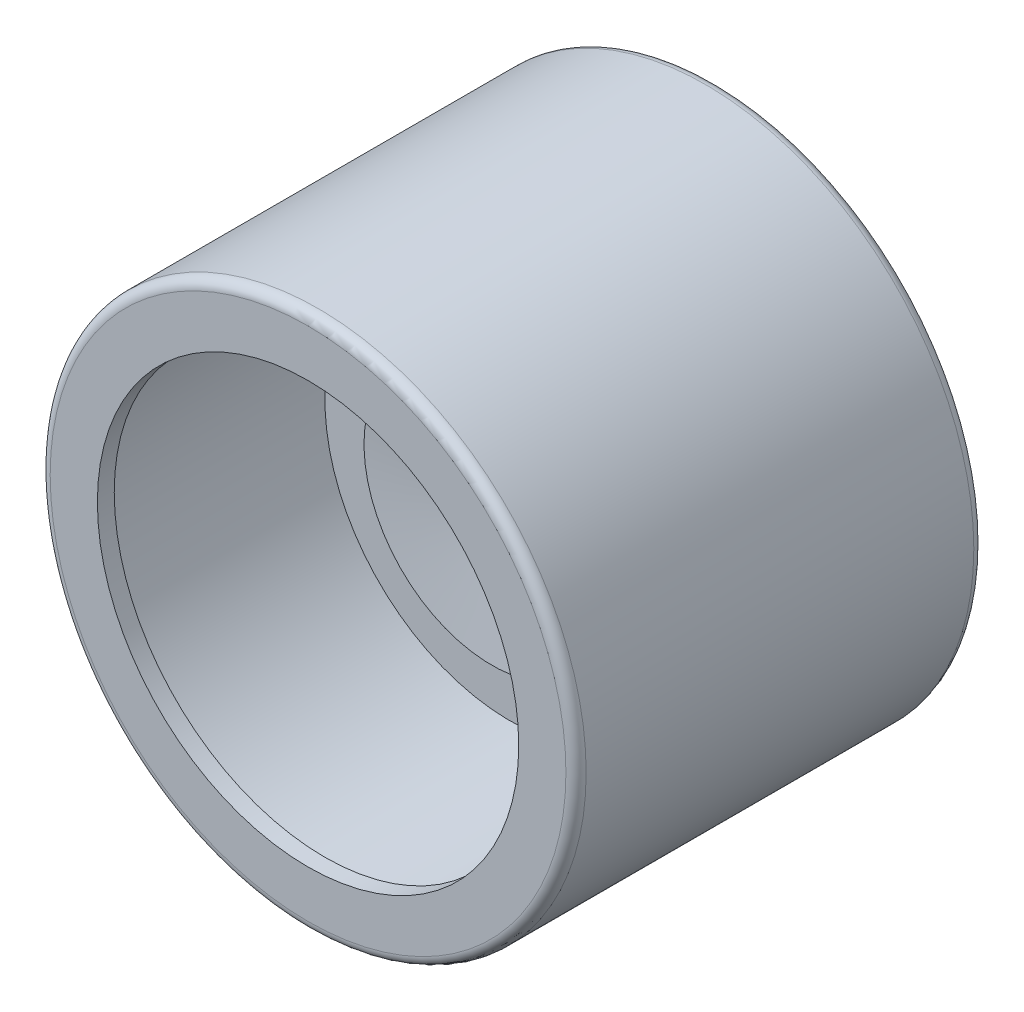
ISO-10303-21;
HEADER;
FILE_DESCRIPTION(('STEP AP214'),'2;1');
FILE_NAME('part.step','',(''),(''),'','','');
FILE_SCHEMA(('AUTOMOTIVE_DESIGN { 1 0 10303 214 1 1 1 1 }'));
ENDSEC;
DATA;
#1=APPLICATION_CONTEXT('core data for automotive mechanical design processes');
#2=APPLICATION_PROTOCOL_DEFINITION('international standard','automotive_design',2000,#1);
#3=PRODUCT_CONTEXT('',#1,'mechanical');
#4=PRODUCT('Part','Part','',(#3));
#5=PRODUCT_RELATED_PRODUCT_CATEGORY('part','',(#4));
#6=PRODUCT_DEFINITION_FORMATION('','',#4);
#7=PRODUCT_DEFINITION_CONTEXT('part definition',#1,'design');
#8=PRODUCT_DEFINITION('design','',#6,#7);
#9=PRODUCT_DEFINITION_SHAPE('','',#8);
#10=(LENGTH_UNIT() NAMED_UNIT(*) SI_UNIT(.MILLI.,.METRE.));
#11=(NAMED_UNIT(*) PLANE_ANGLE_UNIT() SI_UNIT($,.RADIAN.));
#12=(NAMED_UNIT(*) SI_UNIT($,.STERADIAN.) SOLID_ANGLE_UNIT());
#13=UNCERTAINTY_MEASURE_WITH_UNIT(LENGTH_MEASURE(1.E-05),#10,'distance_accuracy_value','');
#14=(GEOMETRIC_REPRESENTATION_CONTEXT(3) GLOBAL_UNCERTAINTY_ASSIGNED_CONTEXT((#13)) GLOBAL_UNIT_ASSIGNED_CONTEXT((#10,
#11,#12)) REPRESENTATION_CONTEXT('',''));
#15=CARTESIAN_POINT('',(0.,0.,0.));
#16=DIRECTION('',(0.,0.,1.));
#17=DIRECTION('',(1.,0.,0.));
#18=AXIS2_PLACEMENT_3D('',#15,#16,#17);
#19=CARTESIAN_POINT('',(0.,0.,6.1));
#20=DIRECTION('',(0.,0.,1.));
#21=DIRECTION('',(1.,0.,0.));
#22=AXIS2_PLACEMENT_3D('',#19,#20,#21);
#23=PLANE('',#22);
#24=CARTESIAN_POINT('',(0.,0.,6.1));
#25=DIRECTION('',(0.,0.,1.));
#26=DIRECTION('',(1.,0.,0.));
#27=AXIS2_PLACEMENT_3D('',#24,#25,#26);
#28=CIRCLE('',#27,5.5);
#29=CARTESIAN_POINT('',(5.5,0.,6.1));
#30=VERTEX_POINT('',#29);
#31=EDGE_CURVE('E86',#30,#30,#28,.T.);
#32=ORIENTED_EDGE('',*,*,#31,.T.);
#33=EDGE_LOOP('',(#32));
#34=FACE_BOUND('',#33,.T.);
#35=CARTESIAN_POINT('',(0.,0.,6.1));
#36=DIRECTION('',(0.,0.,1.));
#37=DIRECTION('',(1.,0.,0.));
#38=AXIS2_PLACEMENT_3D('',#35,#36,#37);
#39=CIRCLE('',#38,3.7909010050328);
#40=CARTESIAN_POINT('',(3.7909010050328,0.,6.1));
#41=VERTEX_POINT('',#40);
#42=EDGE_CURVE('E13',#41,#41,#39,.T.);
#43=ORIENTED_EDGE('',*,*,#42,.F.);
#44=EDGE_LOOP('',(#43));
#45=FACE_BOUND('',#44,.T.);
#46=ADVANCED_FACE('F50',(#34,#45),#23,.T.);
#47=CARTESIAN_POINT('',(0.,0.,12.1));
#48=DIRECTION('',(0.,0.,-1.));
#49=DIRECTION('',(-1.,0.,0.));
#50=AXIS2_PLACEMENT_3D('',#47,#48,#49);
#51=CYLINDRICAL_SURFACE('',#50,7.95);
#52=CARTESIAN_POINT('',(0.,0.,0.3));
#53=DIRECTION('',(0.,0.,1.));
#54=DIRECTION('',(1.,0.,0.));
#55=AXIS2_PLACEMENT_3D('',#52,#53,#54);
#56=CIRCLE('',#55,7.95);
#57=CARTESIAN_POINT('',(7.95,0.,0.3));
#58=VERTEX_POINT('',#57);
#59=EDGE_CURVE('E73',#58,#58,#56,.T.);
#60=ORIENTED_EDGE('',*,*,#59,.T.);
#61=EDGE_LOOP('',(#60));
#62=FACE_BOUND('',#61,.T.);
#63=CARTESIAN_POINT('',(0.,0.,11.8));
#64=DIRECTION('',(0.,0.,1.));
#65=DIRECTION('',(1.,0.,0.));
#66=AXIS2_PLACEMENT_3D('',#63,#64,#65);
#67=CIRCLE('',#66,7.95);
#68=CARTESIAN_POINT('',(7.95,0.,11.8));
#69=VERTEX_POINT('',#68);
#70=EDGE_CURVE('E76',#69,#69,#67,.F.);
#71=ORIENTED_EDGE('',*,*,#70,.T.);
#72=EDGE_LOOP('',(#71));
#73=FACE_BOUND('',#72,.T.);
#74=ADVANCED_FACE('F120',(#62,#73),#51,.T.);
#75=CARTESIAN_POINT('',(0.,0.,12.1));
#76=DIRECTION('',(0.,0.,1.));
#77=DIRECTION('',(1.,0.,0.));
#78=AXIS2_PLACEMENT_3D('',#75,#76,#77);
#79=PLANE('',#78);
#80=CARTESIAN_POINT('',(0.,0.,12.1));
#81=DIRECTION('',(0.,0.,1.));
#82=DIRECTION('',(1.,0.,0.));
#83=AXIS2_PLACEMENT_3D('',#80,#81,#82);
#84=CIRCLE('',#83,7.65);
#85=CARTESIAN_POINT('',(7.65,0.,12.1));
#86=VERTEX_POINT('',#85);
#87=EDGE_CURVE('E65',#86,#86,#84,.T.);
#88=ORIENTED_EDGE('',*,*,#87,.T.);
#89=EDGE_LOOP('',(#88));
#90=FACE_BOUND('',#89,.T.);
#91=CARTESIAN_POINT('',(0.,0.,12.1));
#92=DIRECTION('',(0.,0.,1.));
#93=DIRECTION('',(1.,0.,0.));
#94=AXIS2_PLACEMENT_3D('',#91,#92,#93);
#95=CIRCLE('',#94,6.25);
#96=CARTESIAN_POINT('',(6.25,0.,12.1));
#97=VERTEX_POINT('',#96);
#98=EDGE_CURVE('E83',#97,#97,#95,.T.);
#99=ORIENTED_EDGE('',*,*,#98,.F.);
#100=EDGE_LOOP('',(#99));
#101=FACE_BOUND('',#100,.T.);
#102=ADVANCED_FACE('F125',(#90,#101),#79,.T.);
#103=CARTESIAN_POINT('',(0.,0.,0.));
#104=DIRECTION('',(0.,0.,1.));
#105=DIRECTION('',(1.,0.,0.));
#106=AXIS2_PLACEMENT_3D('',#103,#104,#105);
#107=PLANE('',#106);
#108=CARTESIAN_POINT('',(0.,0.,0.));
#109=DIRECTION('',(0.,0.,1.));
#110=DIRECTION('',(1.,0.,0.));
#111=AXIS2_PLACEMENT_3D('',#108,#109,#110);
#112=CIRCLE('',#111,7.65);
#113=CARTESIAN_POINT('',(7.65,0.,0.));
#114=VERTEX_POINT('',#113);
#115=EDGE_CURVE('E70',#114,#114,#112,.F.);
#116=ORIENTED_EDGE('',*,*,#115,.T.);
#117=EDGE_LOOP('',(#116));
#118=FACE_BOUND('',#117,.T.);
#119=ADVANCED_FACE('F155',(#118),#107,.F.);
#120=CARTESIAN_POINT('',(0.,0.,0.3));
#121=DIRECTION('',(0.,0.,1.));
#122=DIRECTION('',(1.,0.,0.));
#123=AXIS2_PLACEMENT_3D('',#120,#121,#122);
#124=TOROIDAL_SURFACE('',#123,7.65,0.3);
#125=ORIENTED_EDGE('',*,*,#115,.F.);
#126=EDGE_LOOP('',(#125));
#127=FACE_BOUND('',#126,.T.);
#128=ORIENTED_EDGE('',*,*,#59,.F.);
#129=EDGE_LOOP('',(#128));
#130=FACE_BOUND('',#129,.T.);
#131=ADVANCED_FACE('F158',(#127,#130),#124,.T.);
#132=CARTESIAN_POINT('',(0.,0.,11.8));
#133=DIRECTION('',(0.,0.,1.));
#134=DIRECTION('',(1.,0.,0.));
#135=AXIS2_PLACEMENT_3D('',#132,#133,#134);
#136=TOROIDAL_SURFACE('',#135,7.65,0.3);
#137=ORIENTED_EDGE('',*,*,#70,.F.);
#138=EDGE_LOOP('',(#137));
#139=FACE_BOUND('',#138,.T.);
#140=ORIENTED_EDGE('',*,*,#87,.F.);
#141=EDGE_LOOP('',(#140));
#142=FACE_BOUND('',#141,.T.);
#143=ADVANCED_FACE('F52',(#139,#142),#136,.T.);
#144=CARTESIAN_POINT('',(0.,0.,11.6));
#145=DIRECTION('',(0.,0.,1.));
#146=DIRECTION('',(1.,0.,0.));
#147=AXIS2_PLACEMENT_3D('',#144,#145,#146);
#148=PLANE('',#147);
#149=CARTESIAN_POINT('',(0.,0.,11.6));
#150=DIRECTION('',(0.,0.,1.));
#151=DIRECTION('',(1.,0.,0.));
#152=AXIS2_PLACEMENT_3D('',#149,#150,#151);
#153=CIRCLE('',#152,6.25);
#154=CARTESIAN_POINT('',(6.25,0.,11.6));
#155=VERTEX_POINT('',#154);
#156=EDGE_CURVE('E82',#155,#155,#153,.T.);
#157=ORIENTED_EDGE('',*,*,#156,.T.);
#158=EDGE_LOOP('',(#157));
#159=FACE_BOUND('',#158,.T.);
#160=CARTESIAN_POINT('',(0.,0.,11.6));
#161=DIRECTION('',(0.,0.,1.));
#162=DIRECTION('',(1.,0.,0.));
#163=AXIS2_PLACEMENT_3D('',#160,#161,#162);
#164=CIRCLE('',#163,7.5);
#165=CARTESIAN_POINT('',(7.5,0.,11.6));
#166=VERTEX_POINT('',#165);
#167=EDGE_CURVE('E61',#166,#166,#164,.F.);
#168=ORIENTED_EDGE('',*,*,#167,.T.);
#169=EDGE_LOOP('',(#168));
#170=FACE_BOUND('',#169,.T.);
#171=ADVANCED_FACE('F142',(#159,#170),#148,.F.);
#172=CARTESIAN_POINT('',(0.,0.,11.6));
#173=DIRECTION('',(0.,0.,1.));
#174=DIRECTION('',(1.,0.,0.));
#175=AXIS2_PLACEMENT_3D('',#172,#173,#174);
#176=CYLINDRICAL_SURFACE('',#175,6.25);
#177=ORIENTED_EDGE('',*,*,#156,.F.);
#178=EDGE_LOOP('',(#177));
#179=FACE_BOUND('',#178,.T.);
#180=ORIENTED_EDGE('',*,*,#98,.T.);
#181=EDGE_LOOP('',(#180));
#182=FACE_BOUND('',#181,.T.);
#183=ADVANCED_FACE('F138',(#179,#182),#176,.F.);
#184=CARTESIAN_POINT('',(0.,0.,2.1));
#185=DIRECTION('',(0.,0.,1.));
#186=DIRECTION('',(1.,0.,0.));
#187=AXIS2_PLACEMENT_3D('',#184,#185,#186);
#188=PLANE('',#187);
#189=CARTESIAN_POINT('',(0.,0.,2.1));
#190=DIRECTION('',(0.,0.,1.));
#191=DIRECTION('',(1.,0.,0.));
#192=AXIS2_PLACEMENT_3D('',#189,#190,#191);
#193=CIRCLE('',#192,5.5);
#194=CARTESIAN_POINT('',(5.5,0.,2.1));
#195=VERTEX_POINT('',#194);
#196=EDGE_CURVE('E89',#195,#195,#193,.T.);
#197=ORIENTED_EDGE('',*,*,#196,.F.);
#198=EDGE_LOOP('',(#197));
#199=FACE_BOUND('',#198,.T.);
#200=CARTESIAN_POINT('',(0.,0.,2.1));
#201=DIRECTION('',(0.,0.,1.));
#202=DIRECTION('',(1.,0.,0.));
#203=AXIS2_PLACEMENT_3D('',#200,#201,#202);
#204=CIRCLE('',#203,7.5);
#205=CARTESIAN_POINT('',(7.5,0.,2.1));
#206=VERTEX_POINT('',#205);
#207=EDGE_CURVE('E79',#206,#206,#204,.T.);
#208=ORIENTED_EDGE('',*,*,#207,.T.);
#209=EDGE_LOOP('',(#208));
#210=FACE_BOUND('',#209,.T.);
#211=ADVANCED_FACE('F141',(#199,#210),#188,.T.);
#212=CARTESIAN_POINT('',(0.,0.,2.1));
#213=DIRECTION('',(0.,0.,1.));
#214=DIRECTION('',(1.,0.,0.));
#215=AXIS2_PLACEMENT_3D('',#212,#213,#214);
#216=CYLINDRICAL_SURFACE('',#215,7.5);
#217=ORIENTED_EDGE('',*,*,#207,.F.);
#218=EDGE_LOOP('',(#217));
#219=FACE_BOUND('',#218,.T.);
#220=ORIENTED_EDGE('',*,*,#167,.F.);
#221=EDGE_LOOP('',(#220));
#222=FACE_BOUND('',#221,.T.);
#223=ADVANCED_FACE('F136',(#219,#222),#216,.F.);
#224=CARTESIAN_POINT('',(0.,0.,6.1));
#225=DIRECTION('',(0.,0.,-1.));
#226=DIRECTION('',(-1.,0.,0.));
#227=AXIS2_PLACEMENT_3D('',#224,#225,#226);
#228=CYLINDRICAL_SURFACE('',#227,5.5);
#229=ORIENTED_EDGE('',*,*,#31,.F.);
#230=EDGE_LOOP('',(#229));
#231=FACE_BOUND('',#230,.T.);
#232=ORIENTED_EDGE('',*,*,#196,.T.);
#233=EDGE_LOOP('',(#232));
#234=FACE_BOUND('',#233,.T.);
#235=ADVANCED_FACE('F133',(#231,#234),#228,.T.);
#236=CARTESIAN_POINT('',(0.,0.,0.));
#237=DIRECTION('',(0.,0.,-1.));
#238=DIRECTION('',(0.,1.,0.));
#239=AXIS2_PLACEMENT_3D('',#236,#237,#238);
#240=CYLINDRICAL_SURFACE('',#239,3.7909010050328);
#241=ORIENTED_EDGE('',*,*,#42,.T.);
#242=EDGE_LOOP('',(#241));
#243=FACE_BOUND('',#242,.T.);
#244=CARTESIAN_POINT('',(0.,0.,6.65));
#245=DIRECTION('',(0.,0.,-1.));
#246=DIRECTION('',(0.,1.,0.));
#247=AXIS2_PLACEMENT_3D('',#244,#245,#246);
#248=CIRCLE('',#247,3.7909010050328);
#249=CARTESIAN_POINT('',(0.,3.7909010050328,6.65));
#250=VERTEX_POINT('',#249);
#251=EDGE_CURVE('E92',#250,#250,#248,.T.);
#252=ORIENTED_EDGE('',*,*,#251,.T.);
#253=EDGE_LOOP('',(#252));
#254=FACE_BOUND('',#253,.T.);
#255=ADVANCED_FACE('F131',(#243,#254),#240,.T.);
#256=CARTESIAN_POINT('',(0.,0.,6.65));
#257=DIRECTION('',(0.,0.,1.));
#258=DIRECTION('',(0.,-1.,0.));
#259=AXIS2_PLACEMENT_3D('',#256,#257,#258);
#260=CONICAL_SURFACE('',#259,3.7909010050328,1.45108807305091);
#261=CARTESIAN_POINT('',(0.,0.,6.31884257165239));
#262=DIRECTION('',(0.,0.,-1.));
#263=DIRECTION('',(0.,1.,0.));
#264=AXIS2_PLACEMENT_3D('',#261,#262,#263);
#265=CIRCLE('',#264,1.03775684955081);
#266=CARTESIAN_POINT('',(0.,1.03775684955081,6.31884257165239));
#267=VERTEX_POINT('',#266);
#268=EDGE_CURVE('E97',#267,#267,#265,.T.);
#269=ORIENTED_EDGE('',*,*,#268,.T.);
#270=EDGE_LOOP('',(#269));
#271=FACE_BOUND('',#270,.T.);
#272=ORIENTED_EDGE('',*,*,#251,.F.);
#273=EDGE_LOOP('',(#272));
#274=FACE_BOUND('',#273,.T.);
#275=ADVANCED_FACE('F117',(#271,#274),#260,.F.);
#276=CARTESIAN_POINT('',(0.,0.,4.82957729286775));
#277=DIRECTION('',(0.,0.,-1.));
#278=DIRECTION('',(0.,1.,0.));
#279=AXIS2_PLACEMENT_3D('',#276,#277,#278);
#280=DEGENERATE_TOROIDAL_SURFACE('',#279,1.21689068054462,1.5,.T.);
#281=CARTESIAN_POINT('',(0.,0.,6.1194532886291));
#282=DIRECTION('',(0.,0.,-1.));
#283=DIRECTION('',(0.,1.,0.));
#284=AXIS2_PLACEMENT_3D('',#281,#282,#283);
#285=CIRCLE('',#284,0.451240685077581);
#286=CARTESIAN_POINT('',(0.,0.45124068507758,6.1194532886291));
#287=VERTEX_POINT('',#286);
#288=EDGE_CURVE('E100',#287,#287,#285,.T.);
#289=ORIENTED_EDGE('',*,*,#288,.T.);
#290=EDGE_LOOP('',(#289));
#291=FACE_BOUND('',#290,.T.);
#292=ORIENTED_EDGE('',*,*,#268,.F.);
#293=EDGE_LOOP('',(#292));
#294=FACE_BOUND('',#293,.T.);
#295=ADVANCED_FACE('F104',(#291,#294),#280,.T.);
#296=CARTESIAN_POINT('',(0.,0.,6.1194532886291));
#297=DIRECTION('',(0.,0.,1.));
#298=DIRECTION('',(0.,-1.,0.));
#299=AXIS2_PLACEMENT_3D('',#296,#297,#298);
#300=CONICAL_SURFACE('',#299,0.451240685077581,1.0351076909461);
#301=CARTESIAN_POINT('',(0.,0.,6.1));
#302=DIRECTION('',(0.,0.,1.));
#303=DIRECTION('',(1.,0.,0.));
#304=AXIS2_PLACEMENT_3D('',#301,#302,#303);
#305=CIRCLE('',#304,0.418468099444649);
#306=CARTESIAN_POINT('',(0.418468099444649,0.,6.1));
#307=VERTEX_POINT('',#306);
#308=EDGE_CURVE('E57',#307,#307,#305,.F.);
#309=ORIENTED_EDGE('',*,*,#308,.T.);
#310=EDGE_LOOP('',(#309));
#311=FACE_BOUND('',#310,.T.);
#312=ORIENTED_EDGE('',*,*,#288,.F.);
#313=EDGE_LOOP('',(#312));
#314=FACE_BOUND('',#313,.T.);
#315=ADVANCED_FACE('F107',(#311,#314),#300,.F.);
#316=ORIENTED_EDGE('',*,*,#308,.F.);
#317=EDGE_LOOP('',(#316));
#318=FACE_BOUND('',#317,.T.);
#319=ADVANCED_FACE('F109',(#318),#23,.T.);
#320=CLOSED_SHELL('',(#46,#74,#102,#119,#131,#143,#171,#183,#211,#223,#235,#255,#275,#295,#315,#319));
#321=MANIFOLD_SOLID_BREP('B2',#320);
#322=ADVANCED_BREP_SHAPE_REPRESENTATION('',(#18,#321),#14);
#323=SHAPE_DEFINITION_REPRESENTATION(#9,#322);
ENDSEC;
END-ISO-10303-21;
